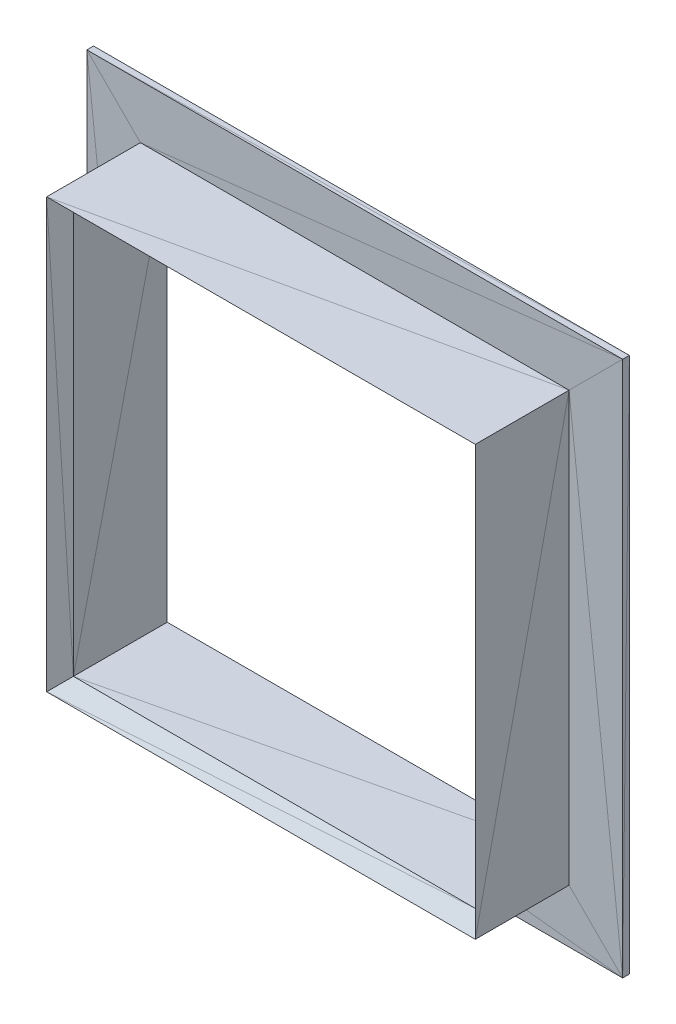
ISO-10303-21;
HEADER;
FILE_DESCRIPTION(('STEP AP214'),'2;1');
FILE_NAME('part.step','',(''),(''),'','','');
FILE_SCHEMA(('AUTOMOTIVE_DESIGN { 1 0 10303 214 1 1 1 1 }'));
ENDSEC;
DATA;
#1=APPLICATION_CONTEXT('core data for automotive mechanical design processes');
#2=APPLICATION_PROTOCOL_DEFINITION('international standard','automotive_design',2000,#1);
#3=PRODUCT_CONTEXT('',#1,'mechanical');
#4=PRODUCT('Part','Part','',(#3));
#5=PRODUCT_RELATED_PRODUCT_CATEGORY('part','',(#4));
#6=PRODUCT_DEFINITION_FORMATION('','',#4);
#7=PRODUCT_DEFINITION_CONTEXT('part definition',#1,'design');
#8=PRODUCT_DEFINITION('design','',#6,#7);
#9=PRODUCT_DEFINITION_SHAPE('','',#8);
#10=(LENGTH_UNIT() NAMED_UNIT(*) SI_UNIT(.MILLI.,.METRE.));
#11=(NAMED_UNIT(*) PLANE_ANGLE_UNIT() SI_UNIT($,.RADIAN.));
#12=(NAMED_UNIT(*) SI_UNIT($,.STERADIAN.) SOLID_ANGLE_UNIT());
#13=UNCERTAINTY_MEASURE_WITH_UNIT(LENGTH_MEASURE(1.E-05),#10,'distance_accuracy_value','');
#14=(GEOMETRIC_REPRESENTATION_CONTEXT(3) GLOBAL_UNCERTAINTY_ASSIGNED_CONTEXT((#13)) GLOBAL_UNIT_ASSIGNED_CONTEXT((#10,
#11,#12)) REPRESENTATION_CONTEXT('',''));
#15=CARTESIAN_POINT('',(0.,0.,0.));
#16=DIRECTION('',(0.,0.,1.));
#17=DIRECTION('',(1.,0.,0.));
#18=AXIS2_PLACEMENT_3D('',#15,#16,#17);
#19=CARTESIAN_POINT('',(0.,-14.9999996647239,0.));
#20=DIRECTION('',(0.,-1.,0.));
#21=DIRECTION('',(0.,0.,-1.));
#22=AXIS2_PLACEMENT_3D('',#19,#20,#21);
#23=PLANE('',#22);
#24=DIRECTION('',(0.,0.,1.));
#25=VECTOR('',#24,1.);
#26=CARTESIAN_POINT('',(14.9999996647239,-14.9999996647239,0.));
#27=LINE('',#26,#25);
#28=CARTESIAN_POINT('',(14.9999996647239,-14.9999996647239,0.));
#29=VERTEX_POINT('',#28);
#30=CARTESIAN_POINT('',(14.9999996647239,-14.9999996647239,7.00000021606684));
#31=VERTEX_POINT('',#30);
#32=EDGE_CURVE('E19',#29,#31,#27,.T.);
#33=ORIENTED_EDGE('',*,*,#32,.F.);
#34=DIRECTION('',(0.97384120706583,0.,-0.227229627074831));
#35=VECTOR('',#34,1.);
#36=CARTESIAN_POINT('',(-14.9999996647239,-14.9999996647239,7.00000021606684));
#37=LINE('',#36,#35);
#38=CARTESIAN_POINT('',(-14.9999996647239,-14.9999996647239,7.00000021606684));
#39=VERTEX_POINT('',#38);
#40=EDGE_CURVE('E133',#39,#29,#37,.T.);
#41=ORIENTED_EDGE('',*,*,#40,.F.);
#42=DIRECTION('',(-1.,0.,0.));
#43=VECTOR('',#42,1.);
#44=CARTESIAN_POINT('',(14.9999996647239,-14.9999996647239,7.00000021606684));
#45=LINE('',#44,#43);
#46=EDGE_CURVE('E151',#31,#39,#45,.T.);
#47=ORIENTED_EDGE('',*,*,#46,.F.);
#48=EDGE_LOOP('',(#33,#41,#47));
#49=FACE_BOUND('',#48,.T.);
#50=ADVANCED_FACE('F16',(#49),#23,.F.);
#51=CARTESIAN_POINT('',(0.,0.,0.));
#52=DIRECTION('',(0.,0.,-1.));
#53=DIRECTION('',(-1.,0.,0.));
#54=AXIS2_PLACEMENT_3D('',#51,#52,#53);
#55=PLANE('',#54);
#56=DIRECTION('',(0.991600408499459,0.129339204666278,0.));
#57=VECTOR('',#56,1.);
#58=CARTESIAN_POINT('',(-14.9999996647239,14.9999996647239,0.));
#59=LINE('',#58,#57);
#60=CARTESIAN_POINT('',(-14.9999996647239,14.9999996647239,0.));
#61=VERTEX_POINT('',#60);
#62=CARTESIAN_POINT('',(19.5000004023314,19.5000004023314,0.));
#63=VERTEX_POINT('',#62);
#64=EDGE_CURVE('E164',#61,#63,#59,.T.);
#65=ORIENTED_EDGE('',*,*,#64,.F.);
#66=DIRECTION('',(0.707106781186548,-0.707106781186548,0.));
#67=VECTOR('',#66,1.);
#68=CARTESIAN_POINT('',(-19.5000004023314,19.5000004023314,0.));
#69=LINE('',#68,#67);
#70=CARTESIAN_POINT('',(-19.5000004023314,19.5000004023314,0.));
#71=VERTEX_POINT('',#70);
#72=EDGE_CURVE('E289',#71,#61,#69,.T.);
#73=ORIENTED_EDGE('',*,*,#72,.F.);
#74=DIRECTION('',(-1.,0.,0.));
#75=VECTOR('',#74,1.);
#76=CARTESIAN_POINT('',(19.5000004023314,19.5000004023314,0.));
#77=LINE('',#76,#75);
#78=EDGE_CURVE('E193',#63,#71,#77,.T.);
#79=ORIENTED_EDGE('',*,*,#78,.F.);
#80=EDGE_LOOP('',(#65,#73,#79));
#81=FACE_BOUND('',#80,.T.);
#82=ADVANCED_FACE('F417',(#81),#55,.T.);
#83=CARTESIAN_POINT('',(14.9999996647239,0.,0.));
#84=DIRECTION('',(1.,0.,0.));
#85=DIRECTION('',(0.,0.,-1.));
#86=AXIS2_PLACEMENT_3D('',#83,#84,#85);
#87=PLANE('',#86);
#88=DIRECTION('',(0.,-1.,0.));
#89=VECTOR('',#88,1.);
#90=CARTESIAN_POINT('',(14.9999996647239,14.9999996647239,7.00000021606684));
#91=LINE('',#90,#89);
#92=CARTESIAN_POINT('',(14.9999996647239,14.9999996647239,7.00000021606684));
#93=VERTEX_POINT('',#92);
#94=EDGE_CURVE('E163',#93,#31,#91,.T.);
#95=ORIENTED_EDGE('',*,*,#94,.F.);
#96=DIRECTION('',(0.,0.97384120706583,0.227229627074831));
#97=VECTOR('',#96,1.);
#98=CARTESIAN_POINT('',(14.9999996647239,-14.9999996647239,0.));
#99=LINE('',#98,#97);
#100=EDGE_CURVE('E155',#29,#93,#99,.T.);
#101=ORIENTED_EDGE('',*,*,#100,.F.);
#102=ORIENTED_EDGE('',*,*,#32,.T.);
#103=EDGE_LOOP('',(#95,#101,#102));
#104=FACE_BOUND('',#103,.T.);
#105=ADVANCED_FACE('F161',(#104),#87,.F.);
#106=CARTESIAN_POINT('',(0.,0.,0.));
#107=DIRECTION('',(0.,0.,1.));
#108=DIRECTION('',(1.,0.,0.));
#109=AXIS2_PLACEMENT_3D('',#106,#107,#108);
#110=PLANE('',#109);
#111=DIRECTION('',(1.,0.,0.));
#112=VECTOR('',#111,1.);
#113=CARTESIAN_POINT('',(-14.9999996647239,14.9999996647239,0.));
#114=LINE('',#113,#112);
#115=CARTESIAN_POINT('',(14.9999996647239,14.9999996647239,0.));
#116=VERTEX_POINT('',#115);
#117=EDGE_CURVE('E171',#61,#116,#114,.T.);
#118=ORIENTED_EDGE('',*,*,#117,.F.);
#119=ORIENTED_EDGE('',*,*,#64,.T.);
#120=DIRECTION('',(0.707106781186548,0.707106781186548,0.));
#121=VECTOR('',#120,1.);
#122=CARTESIAN_POINT('',(14.9999996647239,14.9999996647239,0.));
#123=LINE('',#122,#121);
#124=EDGE_CURVE('E149',#116,#63,#123,.T.);
#125=ORIENTED_EDGE('',*,*,#124,.F.);
#126=EDGE_LOOP('',(#118,#119,#125));
#127=FACE_BOUND('',#126,.T.);
#128=ADVANCED_FACE('F181',(#127),#110,.F.);
#129=CARTESIAN_POINT('',(14.9999996647239,0.,0.));
#130=DIRECTION('',(1.,0.,0.));
#131=DIRECTION('',(0.,0.,-1.));
#132=AXIS2_PLACEMENT_3D('',#129,#130,#131);
#133=PLANE('',#132);
#134=DIRECTION('',(0.,1.,0.));
#135=VECTOR('',#134,1.);
#136=CARTESIAN_POINT('',(14.9999996647239,-14.9999996647239,0.));
#137=LINE('',#136,#135);
#138=EDGE_CURVE('E144',#29,#116,#137,.T.);
#139=ORIENTED_EDGE('',*,*,#138,.F.);
#140=ORIENTED_EDGE('',*,*,#100,.T.);
#141=DIRECTION('',(0.,0.,1.));
#142=VECTOR('',#141,1.);
#143=CARTESIAN_POINT('',(14.9999996647239,14.9999996647239,0.));
#144=LINE('',#143,#142);
#145=EDGE_CURVE('E115',#116,#93,#144,.T.);
#146=ORIENTED_EDGE('',*,*,#145,.F.);
#147=EDGE_LOOP('',(#139,#140,#146));
#148=FACE_BOUND('',#147,.T.);
#149=ADVANCED_FACE('F154',(#148),#133,.F.);
#150=CARTESIAN_POINT('',(0.,0.,0.));
#151=DIRECTION('',(0.,0.,1.));
#152=DIRECTION('',(1.,0.,0.));
#153=AXIS2_PLACEMENT_3D('',#150,#151,#152);
#154=PLANE('',#153);
#155=DIRECTION('',(-0.707106781186548,0.707106781186548,0.));
#156=VECTOR('',#155,1.);
#157=CARTESIAN_POINT('',(19.5000004023314,-19.5000004023314,0.));
#158=LINE('',#157,#156);
#159=CARTESIAN_POINT('',(19.5000004023314,-19.5000004023314,0.));
#160=VERTEX_POINT('',#159);
#161=EDGE_CURVE('E124',#160,#29,#158,.T.);
#162=ORIENTED_EDGE('',*,*,#161,.F.);
#163=DIRECTION('',(0.991600408499459,-0.129339204666278,0.));
#164=VECTOR('',#163,1.);
#165=CARTESIAN_POINT('',(-14.9999996647239,-14.9999996647239,0.));
#166=LINE('',#165,#164);
#167=CARTESIAN_POINT('',(-14.9999996647239,-14.9999996647239,0.));
#168=VERTEX_POINT('',#167);
#169=EDGE_CURVE('E127',#168,#160,#166,.T.);
#170=ORIENTED_EDGE('',*,*,#169,.F.);
#171=DIRECTION('',(-1.,0.,0.));
#172=VECTOR('',#171,1.);
#173=CARTESIAN_POINT('',(14.9999996647239,-14.9999996647239,0.));
#174=LINE('',#173,#172);
#175=EDGE_CURVE('E121',#29,#168,#174,.T.);
#176=ORIENTED_EDGE('',*,*,#175,.F.);
#177=EDGE_LOOP('',(#162,#170,#176));
#178=FACE_BOUND('',#177,.T.);
#179=ADVANCED_FACE('F123',(#178),#154,.F.);
#180=CARTESIAN_POINT('',(0.,0.,0.));
#181=DIRECTION('',(0.,0.,-1.));
#182=DIRECTION('',(-1.,0.,0.));
#183=AXIS2_PLACEMENT_3D('',#180,#181,#182);
#184=PLANE('',#183);
#185=ORIENTED_EDGE('',*,*,#138,.T.);
#186=ORIENTED_EDGE('',*,*,#124,.T.);
#187=DIRECTION('',(0.129339204666278,0.991600408499459,0.));
#188=VECTOR('',#187,1.);
#189=CARTESIAN_POINT('',(14.9999996647239,-14.9999996647239,0.));
#190=LINE('',#189,#188);
#191=EDGE_CURVE('E140',#29,#63,#190,.T.);
#192=ORIENTED_EDGE('',*,*,#191,.F.);
#193=EDGE_LOOP('',(#185,#186,#192));
#194=FACE_BOUND('',#193,.T.);
#195=ADVANCED_FACE('F147',(#194),#184,.T.);
#196=CARTESIAN_POINT('',(0.,0.,0.));
#197=DIRECTION('',(0.,0.,-1.));
#198=DIRECTION('',(-1.,0.,0.));
#199=AXIS2_PLACEMENT_3D('',#196,#197,#198);
#200=PLANE('',#199);
#201=DIRECTION('',(0.,1.,0.));
#202=VECTOR('',#201,1.);
#203=CARTESIAN_POINT('',(19.5000004023314,-19.5000004023314,0.));
#204=LINE('',#203,#202);
#205=EDGE_CURVE('E143',#160,#63,#204,.T.);
#206=ORIENTED_EDGE('',*,*,#205,.F.);
#207=ORIENTED_EDGE('',*,*,#161,.T.);
#208=ORIENTED_EDGE('',*,*,#191,.T.);
#209=EDGE_LOOP('',(#206,#207,#208));
#210=FACE_BOUND('',#209,.T.);
#211=ADVANCED_FACE('F139',(#210),#200,.T.);
#212=CARTESIAN_POINT('',(0.,-3.99999273941528,-3.9999964646982));
#213=DIRECTION('',(0.,-0.707106451914424,-0.707107110458517));
#214=DIRECTION('',(0.,0.707107110458518,-0.707106451914424));
#215=AXIS2_PLACEMENT_3D('',#212,#213,#214);
#216=PLANE('',#215);
#217=DIRECTION('',(0.577350448422543,0.577350448422543,-0.577349910723625));
#218=VECTOR('',#217,1.);
#219=CARTESIAN_POINT('',(-16.0000007599592,-16.0000007599592,8.00000037997961));
#220=LINE('',#219,#218);
#221=CARTESIAN_POINT('',(-16.0000007599592,-16.0000007599592,8.00000037997961));
#222=VERTEX_POINT('',#221);
#223=EDGE_CURVE('E134',#222,#39,#220,.T.);
#224=ORIENTED_EDGE('',*,*,#223,.F.);
#225=DIRECTION('',(-0.998961037402773,-0.0322245844456444,0.0322245544341943));
#226=VECTOR('',#225,1.);
#227=CARTESIAN_POINT('',(14.9999996647239,-14.9999996647239,7.00000021606684));
#228=LINE('',#227,#226);
#229=EDGE_CURVE('E394',#31,#222,#228,.T.);
#230=ORIENTED_EDGE('',*,*,#229,.F.);
#231=ORIENTED_EDGE('',*,*,#46,.T.);
#232=EDGE_LOOP('',(#224,#230,#231));
#233=FACE_BOUND('',#232,.T.);
#234=ADVANCED_FACE('F582',(#233),#216,.F.);
#235=CARTESIAN_POINT('',(-3.99999273941528,0.,-3.99999646469821));
#236=DIRECTION('',(0.707106451914424,0.,0.707107110458518));
#237=DIRECTION('',(0.707107110458517,0.,-0.707106451914424));
#238=AXIS2_PLACEMENT_3D('',#235,#236,#237);
#239=PLANE('',#238);
#240=ORIENTED_EDGE('',*,*,#223,.T.);
#241=DIRECTION('',(0.0322245844456444,-0.998961037402773,-0.0322245544341943));
#242=VECTOR('',#241,1.);
#243=CARTESIAN_POINT('',(-16.0000007599592,16.0000007599592,8.00000037997961));
#244=LINE('',#243,#242);
#245=CARTESIAN_POINT('',(-16.0000007599592,16.0000007599592,8.00000037997961));
#246=VERTEX_POINT('',#245);
#247=EDGE_CURVE('E253',#246,#39,#244,.T.);
#248=ORIENTED_EDGE('',*,*,#247,.F.);
#249=DIRECTION('',(0.,1.,0.));
#250=VECTOR('',#249,1.);
#251=CARTESIAN_POINT('',(-16.0000007599592,-16.0000007599592,8.00000037997961));
#252=LINE('',#251,#250);
#253=EDGE_CURVE('E379',#222,#246,#252,.T.);
#254=ORIENTED_EDGE('',*,*,#253,.F.);
#255=EDGE_LOOP('',(#240,#248,#254));
#256=FACE_BOUND('',#255,.T.);
#257=ADVANCED_FACE('F579',(#256),#239,.T.);
#258=CARTESIAN_POINT('',(0.,-14.9999996647239,0.));
#259=DIRECTION('',(0.,-1.,0.));
#260=DIRECTION('',(0.,0.,-1.));
#261=AXIS2_PLACEMENT_3D('',#258,#259,#260);
#262=PLANE('',#261);
#263=DIRECTION('',(0.,0.,-1.));
#264=VECTOR('',#263,1.);
#265=CARTESIAN_POINT('',(-14.9999996647239,-14.9999996647239,7.00000021606684));
#266=LINE('',#265,#264);
#267=EDGE_CURVE('E169',#39,#168,#266,.T.);
#268=ORIENTED_EDGE('',*,*,#267,.F.);
#269=ORIENTED_EDGE('',*,*,#40,.T.);
#270=ORIENTED_EDGE('',*,*,#175,.T.);
#271=EDGE_LOOP('',(#268,#269,#270));
#272=FACE_BOUND('',#271,.T.);
#273=ADVANCED_FACE('F168',(#272),#262,.F.);
#274=CARTESIAN_POINT('',(0.,14.9999996647239,0.));
#275=DIRECTION('',(0.,1.,0.));
#276=DIRECTION('',(0.,0.,1.));
#277=AXIS2_PLACEMENT_3D('',#274,#275,#276);
#278=PLANE('',#277);
#279=ORIENTED_EDGE('',*,*,#145,.T.);
#280=DIRECTION('',(0.97384120706583,0.,0.227229627074831));
#281=VECTOR('',#280,1.);
#282=CARTESIAN_POINT('',(-14.9999996647239,14.9999996647239,0.));
#283=LINE('',#282,#281);
#284=EDGE_CURVE('E250',#61,#93,#283,.T.);
#285=ORIENTED_EDGE('',*,*,#284,.F.);
#286=ORIENTED_EDGE('',*,*,#117,.T.);
#287=EDGE_LOOP('',(#279,#285,#286));
#288=FACE_BOUND('',#287,.T.);
#289=ADVANCED_FACE('F258',(#288),#278,.F.);
#290=CARTESIAN_POINT('',(-3.99999273941528,0.,-3.9999964646982));
#291=DIRECTION('',(-0.707106451914424,0.,-0.707107110458517));
#292=DIRECTION('',(-0.707107110458518,0.,0.707106451914424));
#293=AXIS2_PLACEMENT_3D('',#290,#291,#292);
#294=PLANE('',#293);
#295=DIRECTION('',(0.577350448422543,-0.577350448422543,-0.577349910723625));
#296=VECTOR('',#295,1.);
#297=CARTESIAN_POINT('',(-16.0000007599592,16.0000007599592,8.00000037997961));
#298=LINE('',#297,#296);
#299=CARTESIAN_POINT('',(-14.9999996647239,14.9999996647239,7.00000021606684));
#300=VERTEX_POINT('',#299);
#301=EDGE_CURVE('E228',#246,#300,#298,.T.);
#302=ORIENTED_EDGE('',*,*,#301,.F.);
#303=ORIENTED_EDGE('',*,*,#247,.T.);
#304=DIRECTION('',(0.,-1.,0.));
#305=VECTOR('',#304,1.);
#306=CARTESIAN_POINT('',(-14.9999996647239,14.9999996647239,7.00000021606684));
#307=LINE('',#306,#305);
#308=EDGE_CURVE('E245',#300,#39,#307,.T.);
#309=ORIENTED_EDGE('',*,*,#308,.F.);
#310=EDGE_LOOP('',(#302,#303,#309));
#311=FACE_BOUND('',#310,.T.);
#312=ADVANCED_FACE('F277',(#311),#294,.F.);
#313=CARTESIAN_POINT('',(-14.9999996647239,0.,0.));
#314=DIRECTION('',(-1.,0.,0.));
#315=DIRECTION('',(0.,0.,1.));
#316=AXIS2_PLACEMENT_3D('',#313,#314,#315);
#317=PLANE('',#316);
#318=DIRECTION('',(0.,-1.,0.));
#319=VECTOR('',#318,1.);
#320=CARTESIAN_POINT('',(-14.9999996647239,14.9999996647239,0.));
#321=LINE('',#320,#319);
#322=EDGE_CURVE('E284',#61,#168,#321,.T.);
#323=ORIENTED_EDGE('',*,*,#322,.F.);
#324=DIRECTION('',(0.,0.97384120706583,-0.227229627074831));
#325=VECTOR('',#324,1.);
#326=CARTESIAN_POINT('',(-14.9999996647239,-14.9999996647239,7.00000021606684));
#327=LINE('',#326,#325);
#328=EDGE_CURVE('E242',#39,#61,#327,.T.);
#329=ORIENTED_EDGE('',*,*,#328,.F.);
#330=ORIENTED_EDGE('',*,*,#267,.T.);
#331=EDGE_LOOP('',(#323,#329,#330));
#332=FACE_BOUND('',#331,.T.);
#333=ADVANCED_FACE('F282',(#332),#317,.F.);
#334=CARTESIAN_POINT('',(0.,14.9999996647239,0.));
#335=DIRECTION('',(0.,1.,0.));
#336=DIRECTION('',(0.,0.,1.));
#337=AXIS2_PLACEMENT_3D('',#334,#335,#336);
#338=PLANE('',#337);
#339=DIRECTION('',(0.,0.,1.));
#340=VECTOR('',#339,1.);
#341=CARTESIAN_POINT('',(-14.9999996647239,14.9999996647239,0.));
#342=LINE('',#341,#340);
#343=EDGE_CURVE('E241',#61,#300,#342,.T.);
#344=ORIENTED_EDGE('',*,*,#343,.F.);
#345=ORIENTED_EDGE('',*,*,#284,.T.);
#346=DIRECTION('',(1.,0.,0.));
#347=VECTOR('',#346,1.);
#348=CARTESIAN_POINT('',(-14.9999996647239,14.9999996647239,7.00000021606684));
#349=LINE('',#348,#347);
#350=EDGE_CURVE('E237',#300,#93,#349,.T.);
#351=ORIENTED_EDGE('',*,*,#350,.F.);
#352=EDGE_LOOP('',(#344,#345,#351));
#353=FACE_BOUND('',#352,.T.);
#354=ADVANCED_FACE('F271',(#353),#338,.F.);
#355=CARTESIAN_POINT('',(-14.9999996647239,0.,0.));
#356=DIRECTION('',(-1.,0.,0.));
#357=DIRECTION('',(0.,0.,1.));
#358=AXIS2_PLACEMENT_3D('',#355,#356,#357);
#359=PLANE('',#358);
#360=ORIENTED_EDGE('',*,*,#308,.T.);
#361=ORIENTED_EDGE('',*,*,#328,.T.);
#362=ORIENTED_EDGE('',*,*,#343,.T.);
#363=EDGE_LOOP('',(#360,#361,#362));
#364=FACE_BOUND('',#363,.T.);
#365=ADVANCED_FACE('F274',(#364),#359,.F.);
#366=CARTESIAN_POINT('',(3.99999273941528,0.,-3.9999964646982));
#367=DIRECTION('',(0.707106451914424,0.,-0.707107110458517));
#368=DIRECTION('',(-0.707107110458518,0.,-0.707106451914424));
#369=AXIS2_PLACEMENT_3D('',#366,#367,#368);
#370=PLANE('',#369);
#371=ORIENTED_EDGE('',*,*,#94,.T.);
#372=DIRECTION('',(-0.0322245844456444,-0.998961037402773,-0.0322245544341943));
#373=VECTOR('',#372,1.);
#374=CARTESIAN_POINT('',(16.0000007599592,16.0000007599592,8.00000037997961));
#375=LINE('',#374,#373);
#376=CARTESIAN_POINT('',(16.0000007599592,16.0000007599592,8.00000037997961));
#377=VERTEX_POINT('',#376);
#378=EDGE_CURVE('E264',#377,#31,#375,.T.);
#379=ORIENTED_EDGE('',*,*,#378,.F.);
#380=DIRECTION('',(0.577350448422543,0.577350448422543,0.577349910723625));
#381=VECTOR('',#380,1.);
#382=CARTESIAN_POINT('',(14.9999996647239,14.9999996647239,7.00000021606684));
#383=LINE('',#382,#381);
#384=EDGE_CURVE('E234',#93,#377,#383,.T.);
#385=ORIENTED_EDGE('',*,*,#384,.F.);
#386=EDGE_LOOP('',(#371,#379,#385));
#387=FACE_BOUND('',#386,.T.);
#388=ADVANCED_FACE('F261',(#387),#370,.F.);
#389=CARTESIAN_POINT('',(0.,3.99999273941528,-3.9999964646982));
#390=DIRECTION('',(0.,0.707106451914424,-0.707107110458517));
#391=DIRECTION('',(0.,0.707107110458518,0.707106451914424));
#392=AXIS2_PLACEMENT_3D('',#389,#390,#391);
#393=PLANE('',#392);
#394=ORIENTED_EDGE('',*,*,#384,.T.);
#395=DIRECTION('',(0.998961037402773,0.0322245844456444,0.0322245544341943));
#396=VECTOR('',#395,1.);
#397=CARTESIAN_POINT('',(-14.9999996647239,14.9999996647239,7.00000021606684));
#398=LINE('',#397,#396);
#399=EDGE_CURVE('E231',#300,#377,#398,.T.);
#400=ORIENTED_EDGE('',*,*,#399,.F.);
#401=ORIENTED_EDGE('',*,*,#350,.T.);
#402=EDGE_LOOP('',(#394,#400,#401));
#403=FACE_BOUND('',#402,.T.);
#404=ADVANCED_FACE('F268',(#403),#393,.F.);
#405=CARTESIAN_POINT('',(0.,-16.0000007599592,0.));
#406=DIRECTION('',(0.,1.,0.));
#407=DIRECTION('',(0.,0.,1.));
#408=AXIS2_PLACEMENT_3D('',#405,#406,#407);
#409=PLANE('',#408);
#410=DIRECTION('',(0.,0.,-1.));
#411=VECTOR('',#410,1.);
#412=CARTESIAN_POINT('',(16.0000007599592,-16.0000007599592,8.00000037997961));
#413=LINE('',#412,#411);
#414=CARTESIAN_POINT('',(16.0000007599592,-16.0000007599592,8.00000037997961));
#415=VERTEX_POINT('',#414);
#416=CARTESIAN_POINT('',(16.0000007599592,-16.0000007599592,1.00000004749745));
#417=VERTEX_POINT('',#416);
#418=EDGE_CURVE('E223',#415,#417,#413,.T.);
#419=ORIENTED_EDGE('',*,*,#418,.F.);
#420=DIRECTION('',(0.976900017396262,0.,0.213696878805432));
#421=VECTOR('',#420,1.);
#422=CARTESIAN_POINT('',(-16.0000007599592,-16.0000007599592,1.00000004749745));
#423=LINE('',#422,#421);
#424=CARTESIAN_POINT('',(-16.0000007599592,-16.0000007599592,1.00000004749745));
#425=VERTEX_POINT('',#424);
#426=EDGE_CURVE('E385',#425,#415,#423,.T.);
#427=ORIENTED_EDGE('',*,*,#426,.F.);
#428=DIRECTION('',(-1.,0.,0.));
#429=VECTOR('',#428,1.);
#430=CARTESIAN_POINT('',(16.0000007599592,-16.0000007599592,1.00000004749745));
#431=LINE('',#430,#429);
#432=EDGE_CURVE('E356',#417,#425,#431,.T.);
#433=ORIENTED_EDGE('',*,*,#432,.F.);
#434=EDGE_LOOP('',(#419,#427,#433));
#435=FACE_BOUND('',#434,.T.);
#436=ADVANCED_FACE('F558',(#435),#409,.F.);
#437=CARTESIAN_POINT('',(0.,3.99999273941528,-3.99999646469821));
#438=DIRECTION('',(0.,-0.707106451914424,0.707107110458518));
#439=DIRECTION('',(0.,-0.707107110458517,-0.707106451914424));
#440=AXIS2_PLACEMENT_3D('',#437,#438,#439);
#441=PLANE('',#440);
#442=ORIENTED_EDGE('',*,*,#301,.T.);
#443=ORIENTED_EDGE('',*,*,#399,.T.);
#444=DIRECTION('',(1.,0.,0.));
#445=VECTOR('',#444,1.);
#446=CARTESIAN_POINT('',(-16.0000007599592,16.0000007599592,8.00000037997961));
#447=LINE('',#446,#445);
#448=EDGE_CURVE('E220',#246,#377,#447,.T.);
#449=ORIENTED_EDGE('',*,*,#448,.F.);
#450=EDGE_LOOP('',(#442,#443,#449));
#451=FACE_BOUND('',#450,.T.);
#452=ADVANCED_FACE('F554',(#451),#441,.T.);
#453=CARTESIAN_POINT('',(0.,16.0000007599592,0.));
#454=DIRECTION('',(0.,-1.,0.));
#455=DIRECTION('',(0.,0.,-1.));
#456=AXIS2_PLACEMENT_3D('',#453,#454,#455);
#457=PLANE('',#456);
#458=DIRECTION('',(0.,0.,-1.));
#459=VECTOR('',#458,1.);
#460=CARTESIAN_POINT('',(-16.0000007599592,16.0000007599592,8.00000037997961));
#461=LINE('',#460,#459);
#462=CARTESIAN_POINT('',(-16.0000007599592,16.0000007599592,1.00000004749745));
#463=VERTEX_POINT('',#462);
#464=EDGE_CURVE('E371',#246,#463,#461,.T.);
#465=ORIENTED_EDGE('',*,*,#464,.F.);
#466=DIRECTION('',(-0.976900017396262,0.,0.213696878805432));
#467=VECTOR('',#466,1.);
#468=CARTESIAN_POINT('',(16.0000007599592,16.0000007599592,1.00000004749745));
#469=LINE('',#468,#467);
#470=CARTESIAN_POINT('',(16.0000007599592,16.0000007599592,1.00000004749745));
#471=VERTEX_POINT('',#470);
#472=EDGE_CURVE('E217',#471,#246,#469,.T.);
#473=ORIENTED_EDGE('',*,*,#472,.F.);
#474=DIRECTION('',(1.,0.,0.));
#475=VECTOR('',#474,1.);
#476=CARTESIAN_POINT('',(-16.0000007599592,16.0000007599592,1.00000004749745));
#477=LINE('',#476,#475);
#478=EDGE_CURVE('E348',#463,#471,#477,.T.);
#479=ORIENTED_EDGE('',*,*,#478,.F.);
#480=EDGE_LOOP('',(#465,#473,#479));
#481=FACE_BOUND('',#480,.T.);
#482=ADVANCED_FACE('F550',(#481),#457,.F.);
#483=CARTESIAN_POINT('',(16.0000007599592,0.,0.));
#484=DIRECTION('',(-1.,0.,0.));
#485=DIRECTION('',(0.,0.,1.));
#486=AXIS2_PLACEMENT_3D('',#483,#484,#485);
#487=PLANE('',#486);
#488=DIRECTION('',(0.,-1.,0.));
#489=VECTOR('',#488,1.);
#490=CARTESIAN_POINT('',(16.0000007599592,16.0000007599592,1.00000004749745));
#491=LINE('',#490,#489);
#492=EDGE_CURVE('E341',#471,#417,#491,.T.);
#493=ORIENTED_EDGE('',*,*,#492,.F.);
#494=DIRECTION('',(0.,0.976900017396262,-0.213696878805432));
#495=VECTOR('',#494,1.);
#496=CARTESIAN_POINT('',(16.0000007599592,-16.0000007599592,8.00000037997961));
#497=LINE('',#496,#495);
#498=EDGE_CURVE('E214',#415,#471,#497,.T.);
#499=ORIENTED_EDGE('',*,*,#498,.F.);
#500=ORIENTED_EDGE('',*,*,#418,.T.);
#501=EDGE_LOOP('',(#493,#499,#500));
#502=FACE_BOUND('',#501,.T.);
#503=ADVANCED_FACE('F546',(#502),#487,.F.);
#504=CARTESIAN_POINT('',(0.,16.0000007599592,0.));
#505=DIRECTION('',(0.,-1.,0.));
#506=DIRECTION('',(0.,0.,-1.));
#507=AXIS2_PLACEMENT_3D('',#504,#505,#506);
#508=PLANE('',#507);
#509=DIRECTION('',(0.,0.,1.));
#510=VECTOR('',#509,1.);
#511=CARTESIAN_POINT('',(16.0000007599592,16.0000007599592,1.00000004749745));
#512=LINE('',#511,#510);
#513=EDGE_CURVE('E194',#471,#377,#512,.T.);
#514=ORIENTED_EDGE('',*,*,#513,.F.);
#515=ORIENTED_EDGE('',*,*,#472,.T.);
#516=ORIENTED_EDGE('',*,*,#448,.T.);
#517=EDGE_LOOP('',(#514,#515,#516));
#518=FACE_BOUND('',#517,.T.);
#519=ADVANCED_FACE('F542',(#518),#508,.F.);
#520=CARTESIAN_POINT('',(16.0000007599592,0.,0.));
#521=DIRECTION('',(-1.,0.,0.));
#522=DIRECTION('',(0.,0.,1.));
#523=AXIS2_PLACEMENT_3D('',#520,#521,#522);
#524=PLANE('',#523);
#525=DIRECTION('',(0.,1.,0.));
#526=VECTOR('',#525,1.);
#527=CARTESIAN_POINT('',(16.0000007599592,-16.0000007599592,8.00000037997961));
#528=LINE('',#527,#526);
#529=EDGE_CURVE('E397',#415,#377,#528,.T.);
#530=ORIENTED_EDGE('',*,*,#529,.F.);
#531=ORIENTED_EDGE('',*,*,#498,.T.);
#532=ORIENTED_EDGE('',*,*,#513,.T.);
#533=EDGE_LOOP('',(#530,#531,#532));
#534=FACE_BOUND('',#533,.T.);
#535=ADVANCED_FACE('F539',(#534),#524,.F.);
#536=CARTESIAN_POINT('',(9.7500172269209,0.,-9.75000020115081));
#537=DIRECTION('',(-0.707107398572264,0.,0.707106163800292));
#538=DIRECTION('',(0.707106163800292,0.,0.707107398572264));
#539=AXIS2_PLACEMENT_3D('',#536,#537,#538);
#540=PLANE('',#539);
#541=DIRECTION('',(-0.577349933126968,-0.577349933126968,-0.577350941314355));
#542=VECTOR('',#541,1.);
#543=CARTESIAN_POINT('',(19.9999995529652,19.9999995529652,0.500000023748726));
#544=LINE('',#543,#542);
#545=CARTESIAN_POINT('',(19.9999995529652,19.9999995529652,0.500000023748726));
#546=VERTEX_POINT('',#545);
#547=EDGE_CURVE('E189',#546,#63,#544,.T.);
#548=ORIENTED_EDGE('',*,*,#547,.F.);
#549=DIRECTION('',(0.0126561786165023,0.999839808032384,0.0126562007171364));
#550=VECTOR('',#549,1.);
#551=CARTESIAN_POINT('',(19.5000004023314,-19.5000004023314,0.));
#552=LINE('',#551,#550);
#553=EDGE_CURVE('E192',#160,#546,#552,.T.);
#554=ORIENTED_EDGE('',*,*,#553,.F.);
#555=ORIENTED_EDGE('',*,*,#205,.T.);
#556=EDGE_LOOP('',(#548,#554,#555));
#557=FACE_BOUND('',#556,.T.);
#558=ADVANCED_FACE('F187',(#557),#540,.F.);
#559=CARTESIAN_POINT('',(0.,9.7500172269209,-9.75000020115081));
#560=DIRECTION('',(0.,-0.707107398572264,0.707106163800292));
#561=DIRECTION('',(0.,-0.707106163800292,-0.707107398572264));
#562=AXIS2_PLACEMENT_3D('',#559,#560,#561);
#563=PLANE('',#562);
#564=DIRECTION('',(0.577349933126968,-0.577349933126968,-0.577350941314355));
#565=VECTOR('',#564,1.);
#566=CARTESIAN_POINT('',(-19.9999995529652,19.9999995529652,0.500000023748726));
#567=LINE('',#566,#565);
#568=CARTESIAN_POINT('',(-19.9999995529652,19.9999995529652,0.500000023748726));
#569=VERTEX_POINT('',#568);
#570=EDGE_CURVE('E202',#569,#71,#567,.T.);
#571=ORIENTED_EDGE('',*,*,#570,.F.);
#572=DIRECTION('',(-0.999839808032384,0.0126561786165023,0.0126562007171364));
#573=VECTOR('',#572,1.);
#574=CARTESIAN_POINT('',(19.5000004023314,19.5000004023314,0.));
#575=LINE('',#574,#573);
#576=EDGE_CURVE('E199',#63,#569,#575,.T.);
#577=ORIENTED_EDGE('',*,*,#576,.F.);
#578=ORIENTED_EDGE('',*,*,#78,.T.);
#579=EDGE_LOOP('',(#571,#577,#578));
#580=FACE_BOUND('',#579,.T.);
#581=ADVANCED_FACE('F200',(#580),#563,.F.);
#582=CARTESIAN_POINT('',(0.,19.9999995529652,0.));
#583=DIRECTION('',(0.,-1.,0.));
#584=DIRECTION('',(0.,0.,-1.));
#585=AXIS2_PLACEMENT_3D('',#582,#583,#584);
#586=PLANE('',#585);
#587=DIRECTION('',(0.,0.,-1.));
#588=VECTOR('',#587,1.);
#589=CARTESIAN_POINT('',(-19.9999995529652,19.9999995529652,1.00000004749745));
#590=LINE('',#589,#588);
#591=CARTESIAN_POINT('',(-19.9999995529652,19.9999995529652,1.00000004749745));
#592=VERTEX_POINT('',#591);
#593=EDGE_CURVE('E319',#592,#569,#590,.T.);
#594=ORIENTED_EDGE('',*,*,#593,.F.);
#595=DIRECTION('',(-0.99992188414317,0.,0.0124990244248364));
#596=VECTOR('',#595,1.);
#597=CARTESIAN_POINT('',(19.9999995529652,19.9999995529652,0.500000023748726));
#598=LINE('',#597,#596);
#599=EDGE_CURVE('E374',#546,#592,#598,.T.);
#600=ORIENTED_EDGE('',*,*,#599,.F.);
#601=DIRECTION('',(1.,0.,0.));
#602=VECTOR('',#601,1.);
#603=CARTESIAN_POINT('',(-19.9999995529652,19.9999995529652,0.500000023748726));
#604=LINE('',#603,#602);
#605=EDGE_CURVE('E207',#569,#546,#604,.T.);
#606=ORIENTED_EDGE('',*,*,#605,.F.);
#607=EDGE_LOOP('',(#594,#600,#606));
#608=FACE_BOUND('',#607,.T.);
#609=ADVANCED_FACE('F531',(#608),#586,.F.);
#610=CARTESIAN_POINT('',(0.,9.7500172269209,-9.75000020115081));
#611=DIRECTION('',(0.,0.707107398572264,-0.707106163800292));
#612=DIRECTION('',(0.,0.707106163800292,0.707107398572264));
#613=AXIS2_PLACEMENT_3D('',#610,#611,#612);
#614=PLANE('',#613);
#615=ORIENTED_EDGE('',*,*,#547,.T.);
#616=ORIENTED_EDGE('',*,*,#576,.T.);
#617=ORIENTED_EDGE('',*,*,#605,.T.);
#618=EDGE_LOOP('',(#615,#616,#617));
#619=FACE_BOUND('',#618,.T.);
#620=ADVANCED_FACE('F209',(#619),#614,.T.);
#621=CARTESIAN_POINT('',(0.,-9.7500172269209,-9.75000020115081));
#622=DIRECTION('',(0.,0.707107398572264,0.707106163800292));
#623=DIRECTION('',(0.,-0.707106163800292,0.707107398572264));
#624=AXIS2_PLACEMENT_3D('',#621,#622,#623);
#625=PLANE('',#624);
#626=DIRECTION('',(-0.577349933126968,0.577349933126968,-0.577350941314355));
#627=VECTOR('',#626,1.);
#628=CARTESIAN_POINT('',(19.9999995529652,-19.9999995529652,0.500000023748726));
#629=LINE('',#628,#627);
#630=CARTESIAN_POINT('',(19.9999995529652,-19.9999995529652,0.500000023748726));
#631=VERTEX_POINT('',#630);
#632=EDGE_CURVE('E306',#631,#160,#629,.T.);
#633=ORIENTED_EDGE('',*,*,#632,.F.);
#634=DIRECTION('',(0.999839808032384,-0.0126561786165023,0.0126562007171364));
#635=VECTOR('',#634,1.);
#636=CARTESIAN_POINT('',(-19.5000004023314,-19.5000004023314,0.));
#637=LINE('',#636,#635);
#638=CARTESIAN_POINT('',(-19.5000004023314,-19.5000004023314,0.));
#639=VERTEX_POINT('',#638);
#640=EDGE_CURVE('E308',#639,#631,#637,.T.);
#641=ORIENTED_EDGE('',*,*,#640,.F.);
#642=DIRECTION('',(-1.,0.,0.));
#643=VECTOR('',#642,1.);
#644=CARTESIAN_POINT('',(19.5000004023314,-19.5000004023314,0.));
#645=LINE('',#644,#643);
#646=EDGE_CURVE('E293',#160,#639,#645,.T.);
#647=ORIENTED_EDGE('',*,*,#646,.F.);
#648=EDGE_LOOP('',(#633,#641,#647));
#649=FACE_BOUND('',#648,.T.);
#650=ADVANCED_FACE('F305',(#649),#625,.F.);
#651=CARTESIAN_POINT('',(0.,0.,0.));
#652=DIRECTION('',(0.,0.,-1.));
#653=DIRECTION('',(-1.,0.,0.));
#654=AXIS2_PLACEMENT_3D('',#651,#652,#653);
#655=PLANE('',#654);
#656=ORIENTED_EDGE('',*,*,#646,.T.);
#657=DIRECTION('',(-0.707106781186548,-0.707106781186548,0.));
#658=VECTOR('',#657,1.);
#659=CARTESIAN_POINT('',(-14.9999996647239,-14.9999996647239,0.));
#660=LINE('',#659,#658);
#661=EDGE_CURVE('E288',#168,#639,#660,.T.);
#662=ORIENTED_EDGE('',*,*,#661,.F.);
#663=ORIENTED_EDGE('',*,*,#169,.T.);
#664=EDGE_LOOP('',(#656,#662,#663));
#665=FACE_BOUND('',#664,.T.);
#666=ADVANCED_FACE('F301',(#665),#655,.T.);
#667=CARTESIAN_POINT('',(0.,0.,0.));
#668=DIRECTION('',(0.,0.,-1.));
#669=DIRECTION('',(-1.,0.,0.));
#670=AXIS2_PLACEMENT_3D('',#667,#668,#669);
#671=PLANE('',#670);
#672=DIRECTION('',(0.,-1.,0.));
#673=VECTOR('',#672,1.);
#674=CARTESIAN_POINT('',(-19.5000004023314,19.5000004023314,0.));
#675=LINE('',#674,#673);
#676=EDGE_CURVE('E403',#71,#639,#675,.T.);
#677=ORIENTED_EDGE('',*,*,#676,.F.);
#678=ORIENTED_EDGE('',*,*,#72,.T.);
#679=DIRECTION('',(0.129339204666278,0.991600408499459,0.));
#680=VECTOR('',#679,1.);
#681=CARTESIAN_POINT('',(-19.5000004023314,-19.5000004023314,0.));
#682=LINE('',#681,#680);
#683=EDGE_CURVE('E291',#639,#61,#682,.T.);
#684=ORIENTED_EDGE('',*,*,#683,.F.);
#685=EDGE_LOOP('',(#677,#678,#684));
#686=FACE_BOUND('',#685,.T.);
#687=ADVANCED_FACE('F416',(#686),#671,.T.);
#688=CARTESIAN_POINT('',(0.,0.,0.));
#689=DIRECTION('',(0.,0.,-1.));
#690=DIRECTION('',(-1.,0.,0.));
#691=AXIS2_PLACEMENT_3D('',#688,#689,#690);
#692=PLANE('',#691);
#693=ORIENTED_EDGE('',*,*,#322,.T.);
#694=ORIENTED_EDGE('',*,*,#661,.T.);
#695=ORIENTED_EDGE('',*,*,#683,.T.);
#696=EDGE_LOOP('',(#693,#694,#695));
#697=FACE_BOUND('',#696,.T.);
#698=ADVANCED_FACE('F413',(#697),#692,.T.);
#699=CARTESIAN_POINT('',(0.,-9.7500172269209,-9.75000020115081));
#700=DIRECTION('',(0.,-0.707107398572264,-0.707106163800292));
#701=DIRECTION('',(0.,0.707106163800292,-0.707107398572264));
#702=AXIS2_PLACEMENT_3D('',#699,#700,#701);
#703=PLANE('',#702);
#704=DIRECTION('',(-0.577349933126968,-0.577349933126968,0.577350941314355));
#705=VECTOR('',#704,1.);
#706=CARTESIAN_POINT('',(-19.5000004023314,-19.5000004023314,0.));
#707=LINE('',#706,#705);
#708=CARTESIAN_POINT('',(-19.9999995529652,-19.9999995529652,0.500000023748726));
#709=VERTEX_POINT('',#708);
#710=EDGE_CURVE('E407',#639,#709,#707,.T.);
#711=ORIENTED_EDGE('',*,*,#710,.F.);
#712=ORIENTED_EDGE('',*,*,#640,.T.);
#713=DIRECTION('',(1.,0.,0.));
#714=VECTOR('',#713,1.);
#715=CARTESIAN_POINT('',(-19.9999995529652,-19.9999995529652,0.500000023748726));
#716=LINE('',#715,#714);
#717=EDGE_CURVE('E950',#709,#631,#716,.T.);
#718=ORIENTED_EDGE('',*,*,#717,.F.);
#719=EDGE_LOOP('',(#711,#712,#718));
#720=FACE_BOUND('',#719,.T.);
#721=ADVANCED_FACE('F517',(#720),#703,.T.);
#722=CARTESIAN_POINT('',(-9.7500172269209,0.,-9.75000020115081));
#723=DIRECTION('',(0.707107398572264,0.,0.707106163800292));
#724=DIRECTION('',(0.707106163800292,0.,-0.707107398572264));
#725=AXIS2_PLACEMENT_3D('',#722,#723,#724);
#726=PLANE('',#725);
#727=DIRECTION('',(0.,-1.,0.));
#728=VECTOR('',#727,1.);
#729=CARTESIAN_POINT('',(-19.9999995529652,19.9999995529652,0.500000023748726));
#730=LINE('',#729,#728);
#731=EDGE_CURVE('E326',#569,#709,#730,.T.);
#732=ORIENTED_EDGE('',*,*,#731,.F.);
#733=DIRECTION('',(-0.0126561786165023,0.999839808032384,0.0126562007171364));
#734=VECTOR('',#733,1.);
#735=CARTESIAN_POINT('',(-19.5000004023314,-19.5000004023314,0.));
#736=LINE('',#735,#734);
#737=EDGE_CURVE('E400',#639,#569,#736,.T.);
#738=ORIENTED_EDGE('',*,*,#737,.F.);
#739=ORIENTED_EDGE('',*,*,#710,.T.);
#740=EDGE_LOOP('',(#732,#738,#739));
#741=FACE_BOUND('',#740,.T.);
#742=ADVANCED_FACE('F513',(#741),#726,.F.);
#743=CARTESIAN_POINT('',(-9.7500172269209,0.,-9.75000020115081));
#744=DIRECTION('',(0.707107398572264,0.,0.707106163800292));
#745=DIRECTION('',(0.707106163800292,0.,-0.707107398572264));
#746=AXIS2_PLACEMENT_3D('',#743,#744,#745);
#747=PLANE('',#746);
#748=ORIENTED_EDGE('',*,*,#676,.T.);
#749=ORIENTED_EDGE('',*,*,#737,.T.);
#750=ORIENTED_EDGE('',*,*,#570,.T.);
#751=EDGE_LOOP('',(#748,#749,#750));
#752=FACE_BOUND('',#751,.T.);
#753=ADVANCED_FACE('F509',(#752),#747,.F.);
#754=CARTESIAN_POINT('',(3.99999273941528,0.,-3.9999964646982));
#755=DIRECTION('',(0.707106451914424,0.,-0.707107110458517));
#756=DIRECTION('',(-0.707107110458518,0.,-0.707106451914424));
#757=AXIS2_PLACEMENT_3D('',#754,#755,#756);
#758=PLANE('',#757);
#759=ORIENTED_EDGE('',*,*,#529,.T.);
#760=ORIENTED_EDGE('',*,*,#378,.T.);
#761=DIRECTION('',(-0.577350448422543,0.577350448422543,-0.577349910723625));
#762=VECTOR('',#761,1.);
#763=CARTESIAN_POINT('',(16.0000007599592,-16.0000007599592,8.00000037997961));
#764=LINE('',#763,#762);
#765=EDGE_CURVE('E389',#415,#31,#764,.T.);
#766=ORIENTED_EDGE('',*,*,#765,.F.);
#767=EDGE_LOOP('',(#759,#760,#766));
#768=FACE_BOUND('',#767,.T.);
#769=ADVANCED_FACE('F505',(#768),#758,.F.);
#770=CARTESIAN_POINT('',(0.,-3.99999273941528,-3.99999646469821));
#771=DIRECTION('',(0.,0.707106451914424,0.707107110458518));
#772=DIRECTION('',(0.,-0.707107110458517,0.707106451914424));
#773=AXIS2_PLACEMENT_3D('',#770,#771,#772);
#774=PLANE('',#773);
#775=ORIENTED_EDGE('',*,*,#765,.T.);
#776=ORIENTED_EDGE('',*,*,#229,.T.);
#777=DIRECTION('',(-1.,0.,0.));
#778=VECTOR('',#777,1.);
#779=CARTESIAN_POINT('',(16.0000007599592,-16.0000007599592,8.00000037997961));
#780=LINE('',#779,#778);
#781=EDGE_CURVE('E386',#415,#222,#780,.T.);
#782=ORIENTED_EDGE('',*,*,#781,.F.);
#783=EDGE_LOOP('',(#775,#776,#782));
#784=FACE_BOUND('',#783,.T.);
#785=ADVANCED_FACE('F501',(#784),#774,.T.);
#786=CARTESIAN_POINT('',(0.,-16.0000007599592,0.));
#787=DIRECTION('',(0.,1.,0.));
#788=DIRECTION('',(0.,0.,1.));
#789=AXIS2_PLACEMENT_3D('',#786,#787,#788);
#790=PLANE('',#789);
#791=DIRECTION('',(0.,0.,1.));
#792=VECTOR('',#791,1.);
#793=CARTESIAN_POINT('',(-16.0000007599592,-16.0000007599592,1.00000004749745));
#794=LINE('',#793,#792);
#795=EDGE_CURVE('E382',#425,#222,#794,.T.);
#796=ORIENTED_EDGE('',*,*,#795,.F.);
#797=ORIENTED_EDGE('',*,*,#426,.T.);
#798=ORIENTED_EDGE('',*,*,#781,.T.);
#799=EDGE_LOOP('',(#796,#797,#798));
#800=FACE_BOUND('',#799,.T.);
#801=ADVANCED_FACE('F497',(#800),#790,.F.);
#802=CARTESIAN_POINT('',(-16.0000007599592,0.,0.));
#803=DIRECTION('',(1.,0.,0.));
#804=DIRECTION('',(0.,0.,-1.));
#805=AXIS2_PLACEMENT_3D('',#802,#803,#804);
#806=PLANE('',#805);
#807=ORIENTED_EDGE('',*,*,#253,.T.);
#808=DIRECTION('',(0.,0.976900017396262,0.213696878805432));
#809=VECTOR('',#808,1.);
#810=CARTESIAN_POINT('',(-16.0000007599592,-16.0000007599592,1.00000004749745));
#811=LINE('',#810,#809);
#812=EDGE_CURVE('E370',#425,#246,#811,.T.);
#813=ORIENTED_EDGE('',*,*,#812,.F.);
#814=ORIENTED_EDGE('',*,*,#795,.T.);
#815=EDGE_LOOP('',(#807,#813,#814));
#816=FACE_BOUND('',#815,.T.);
#817=ADVANCED_FACE('F493',(#816),#806,.F.);
#818=CARTESIAN_POINT('',(0.,19.9999995529652,0.));
#819=DIRECTION('',(0.,-1.,0.));
#820=DIRECTION('',(0.,0.,-1.));
#821=AXIS2_PLACEMENT_3D('',#818,#819,#820);
#822=PLANE('',#821);
#823=DIRECTION('',(0.,0.,1.));
#824=VECTOR('',#823,1.);
#825=CARTESIAN_POINT('',(19.9999995529652,19.9999995529652,0.500000023748726));
#826=LINE('',#825,#824);
#827=CARTESIAN_POINT('',(19.9999995529652,19.9999995529652,1.00000004749745));
#828=VERTEX_POINT('',#827);
#829=EDGE_CURVE('E351',#546,#828,#826,.T.);
#830=ORIENTED_EDGE('',*,*,#829,.F.);
#831=ORIENTED_EDGE('',*,*,#599,.T.);
#832=DIRECTION('',(-1.,0.,0.));
#833=VECTOR('',#832,1.);
#834=CARTESIAN_POINT('',(19.9999995529652,19.9999995529652,1.00000004749745));
#835=LINE('',#834,#833);
#836=EDGE_CURVE('E367',#828,#592,#835,.T.);
#837=ORIENTED_EDGE('',*,*,#836,.F.);
#838=EDGE_LOOP('',(#830,#831,#837));
#839=FACE_BOUND('',#838,.T.);
#840=ADVANCED_FACE('F489',(#839),#822,.F.);
#841=CARTESIAN_POINT('',(-16.0000007599592,0.,0.));
#842=DIRECTION('',(1.,0.,0.));
#843=DIRECTION('',(0.,0.,-1.));
#844=AXIS2_PLACEMENT_3D('',#841,#842,#843);
#845=PLANE('',#844);
#846=DIRECTION('',(0.,1.,0.));
#847=VECTOR('',#846,1.);
#848=CARTESIAN_POINT('',(-16.0000007599592,-16.0000007599592,1.00000004749745));
#849=LINE('',#848,#847);
#850=EDGE_CURVE('E362',#425,#463,#849,.T.);
#851=ORIENTED_EDGE('',*,*,#850,.F.);
#852=ORIENTED_EDGE('',*,*,#812,.T.);
#853=ORIENTED_EDGE('',*,*,#464,.T.);
#854=EDGE_LOOP('',(#851,#852,#853));
#855=FACE_BOUND('',#854,.T.);
#856=ADVANCED_FACE('F485',(#855),#845,.F.);
#857=CARTESIAN_POINT('',(0.,0.,1.00000004749745));
#858=DIRECTION('',(0.,0.,1.));
#859=DIRECTION('',(1.,0.,0.));
#860=AXIS2_PLACEMENT_3D('',#857,#858,#859);
#861=PLANE('',#860);
#862=ORIENTED_EDGE('',*,*,#836,.T.);
#863=DIRECTION('',(-0.707106781186548,0.707106781186548,0.));
#864=VECTOR('',#863,1.);
#865=CARTESIAN_POINT('',(-16.0000007599592,16.0000007599592,1.00000004749745));
#866=LINE('',#865,#864);
#867=EDGE_CURVE('E360',#463,#592,#866,.T.);
#868=ORIENTED_EDGE('',*,*,#867,.F.);
#869=DIRECTION('',(-0.993883738436327,-0.110431492210468,0.));
#870=VECTOR('',#869,1.);
#871=CARTESIAN_POINT('',(19.9999995529652,19.9999995529652,1.00000004749745));
#872=LINE('',#871,#870);
#873=EDGE_CURVE('E347',#828,#463,#872,.T.);
#874=ORIENTED_EDGE('',*,*,#873,.F.);
#875=EDGE_LOOP('',(#862,#868,#874));
#876=FACE_BOUND('',#875,.T.);
#877=ADVANCED_FACE('F482',(#876),#861,.T.);
#878=CARTESIAN_POINT('',(0.,0.,1.00000004749745));
#879=DIRECTION('',(0.,0.,1.));
#880=DIRECTION('',(1.,0.,0.));
#881=AXIS2_PLACEMENT_3D('',#878,#879,#880);
#882=PLANE('',#881);
#883=DIRECTION('',(0.,1.,0.));
#884=VECTOR('',#883,1.);
#885=CARTESIAN_POINT('',(-19.9999995529652,-19.9999995529652,1.00000004749745));
#886=LINE('',#885,#884);
#887=CARTESIAN_POINT('',(-19.9999995529652,-19.9999995529652,1.00000004749745));
#888=VERTEX_POINT('',#887);
#889=EDGE_CURVE('E34',#888,#592,#886,.T.);
#890=ORIENTED_EDGE('',*,*,#889,.F.);
#891=DIRECTION('',(-0.707106781186548,-0.707106781186548,0.));
#892=VECTOR('',#891,1.);
#893=CARTESIAN_POINT('',(-16.0000007599592,-16.0000007599592,1.00000004749745));
#894=LINE('',#893,#892);
#895=EDGE_CURVE('E954',#425,#888,#894,.T.);
#896=ORIENTED_EDGE('',*,*,#895,.F.);
#897=DIRECTION('',(0.110431492210468,-0.993883738436327,0.));
#898=VECTOR('',#897,1.);
#899=CARTESIAN_POINT('',(-19.9999995529652,19.9999995529652,1.00000004749745));
#900=LINE('',#899,#898);
#901=EDGE_CURVE('E359',#592,#425,#900,.T.);
#902=ORIENTED_EDGE('',*,*,#901,.F.);
#903=EDGE_LOOP('',(#890,#896,#902));
#904=FACE_BOUND('',#903,.T.);
#905=ADVANCED_FACE('F478',(#904),#882,.T.);
#906=CARTESIAN_POINT('',(0.,0.,1.00000004749745));
#907=DIRECTION('',(0.,0.,1.));
#908=DIRECTION('',(1.,0.,0.));
#909=AXIS2_PLACEMENT_3D('',#906,#907,#908);
#910=PLANE('',#909);
#911=ORIENTED_EDGE('',*,*,#850,.T.);
#912=ORIENTED_EDGE('',*,*,#867,.T.);
#913=ORIENTED_EDGE('',*,*,#901,.T.);
#914=EDGE_LOOP('',(#911,#912,#913));
#915=FACE_BOUND('',#914,.T.);
#916=ADVANCED_FACE('F474',(#915),#910,.T.);
#917=CARTESIAN_POINT('',(0.,0.,1.00000004749745));
#918=DIRECTION('',(0.,0.,-1.));
#919=DIRECTION('',(-1.,0.,0.));
#920=AXIS2_PLACEMENT_3D('',#917,#918,#919);
#921=PLANE('',#920);
#922=ORIENTED_EDGE('',*,*,#432,.T.);
#923=DIRECTION('',(-0.993883738436327,0.110431492210468,0.));
#924=VECTOR('',#923,1.);
#925=CARTESIAN_POINT('',(19.9999995529652,-19.9999995529652,1.00000004749745));
#926=LINE('',#925,#924);
#927=CARTESIAN_POINT('',(19.9999995529652,-19.9999995529652,1.00000004749745));
#928=VERTEX_POINT('',#927);
#929=EDGE_CURVE('E958',#928,#425,#926,.T.);
#930=ORIENTED_EDGE('',*,*,#929,.F.);
#931=DIRECTION('',(0.707106781186548,-0.707106781186548,0.));
#932=VECTOR('',#931,1.);
#933=CARTESIAN_POINT('',(16.0000007599592,-16.0000007599592,1.00000004749745));
#934=LINE('',#933,#932);
#935=EDGE_CURVE('E344',#417,#928,#934,.T.);
#936=ORIENTED_EDGE('',*,*,#935,.F.);
#937=EDGE_LOOP('',(#922,#930,#936));
#938=FACE_BOUND('',#937,.T.);
#939=ADVANCED_FACE('F470',(#938),#921,.F.);
#940=CARTESIAN_POINT('',(19.9999995529652,0.,0.));
#941=DIRECTION('',(-1.,0.,0.));
#942=DIRECTION('',(0.,0.,1.));
#943=AXIS2_PLACEMENT_3D('',#940,#941,#942);
#944=PLANE('',#943);
#945=DIRECTION('',(0.,1.,0.));
#946=VECTOR('',#945,1.);
#947=CARTESIAN_POINT('',(19.9999995529652,-19.9999995529652,1.00000004749745));
#948=LINE('',#947,#946);
#949=EDGE_CURVE('E336',#928,#828,#948,.T.);
#950=ORIENTED_EDGE('',*,*,#949,.F.);
#951=DIRECTION('',(0.,-0.99992188414317,0.0124990244248364));
#952=VECTOR('',#951,1.);
#953=CARTESIAN_POINT('',(19.9999995529652,19.9999995529652,0.500000023748726));
#954=LINE('',#953,#952);
#955=EDGE_CURVE('E315',#546,#928,#954,.T.);
#956=ORIENTED_EDGE('',*,*,#955,.F.);
#957=ORIENTED_EDGE('',*,*,#829,.T.);
#958=EDGE_LOOP('',(#950,#956,#957));
#959=FACE_BOUND('',#958,.T.);
#960=ADVANCED_FACE('F466',(#959),#944,.F.);
#961=CARTESIAN_POINT('',(0.,0.,1.00000004749745));
#962=DIRECTION('',(0.,0.,-1.));
#963=DIRECTION('',(-1.,0.,0.));
#964=AXIS2_PLACEMENT_3D('',#961,#962,#963);
#965=PLANE('',#964);
#966=DIRECTION('',(-0.707106781186548,-0.707106781186548,0.));
#967=VECTOR('',#966,1.);
#968=CARTESIAN_POINT('',(19.9999995529652,19.9999995529652,1.00000004749745));
#969=LINE('',#968,#967);
#970=EDGE_CURVE('E333',#828,#471,#969,.T.);
#971=ORIENTED_EDGE('',*,*,#970,.F.);
#972=ORIENTED_EDGE('',*,*,#873,.T.);
#973=ORIENTED_EDGE('',*,*,#478,.T.);
#974=EDGE_LOOP('',(#971,#972,#973));
#975=FACE_BOUND('',#974,.T.);
#976=ADVANCED_FACE('F462',(#975),#965,.F.);
#977=CARTESIAN_POINT('',(0.,0.,1.00000004749745));
#978=DIRECTION('',(0.,0.,1.));
#979=DIRECTION('',(1.,0.,0.));
#980=AXIS2_PLACEMENT_3D('',#977,#978,#979);
#981=PLANE('',#980);
#982=ORIENTED_EDGE('',*,*,#492,.T.);
#983=ORIENTED_EDGE('',*,*,#935,.T.);
#984=DIRECTION('',(0.110431492210468,-0.993883738436327,0.));
#985=VECTOR('',#984,1.);
#986=CARTESIAN_POINT('',(16.0000007599592,16.0000007599592,1.00000004749745));
#987=LINE('',#986,#985);
#988=EDGE_CURVE('E332',#471,#928,#987,.T.);
#989=ORIENTED_EDGE('',*,*,#988,.F.);
#990=EDGE_LOOP('',(#982,#983,#989));
#991=FACE_BOUND('',#990,.T.);
#992=ADVANCED_FACE('F458',(#991),#981,.T.);
#993=CARTESIAN_POINT('',(0.,0.,1.00000004749745));
#994=DIRECTION('',(0.,0.,1.));
#995=DIRECTION('',(1.,0.,0.));
#996=AXIS2_PLACEMENT_3D('',#993,#994,#995);
#997=PLANE('',#996);
#998=ORIENTED_EDGE('',*,*,#949,.T.);
#999=ORIENTED_EDGE('',*,*,#970,.T.);
#1000=ORIENTED_EDGE('',*,*,#988,.T.);
#1001=EDGE_LOOP('',(#998,#999,#1000));
#1002=FACE_BOUND('',#1001,.T.);
#1003=ADVANCED_FACE('F454',(#1002),#997,.T.);
#1004=CARTESIAN_POINT('',(-19.9999995529652,0.,0.));
#1005=DIRECTION('',(1.,0.,0.));
#1006=DIRECTION('',(0.,0.,-1.));
#1007=AXIS2_PLACEMENT_3D('',#1004,#1005,#1006);
#1008=PLANE('',#1007);
#1009=ORIENTED_EDGE('',*,*,#889,.T.);
#1010=DIRECTION('',(0.,0.99992188414317,0.0124990244248364));
#1011=VECTOR('',#1010,1.);
#1012=CARTESIAN_POINT('',(-19.9999995529652,-19.9999995529652,0.500000023748726));
#1013=LINE('',#1012,#1011);
#1014=EDGE_CURVE('E323',#709,#592,#1013,.T.);
#1015=ORIENTED_EDGE('',*,*,#1014,.F.);
#1016=DIRECTION('',(0.,0.,-1.));
#1017=VECTOR('',#1016,1.);
#1018=CARTESIAN_POINT('',(-19.9999995529652,-19.9999995529652,1.00000004749745));
#1019=LINE('',#1018,#1017);
#1020=EDGE_CURVE('E946',#888,#709,#1019,.T.);
#1021=ORIENTED_EDGE('',*,*,#1020,.F.);
#1022=EDGE_LOOP('',(#1009,#1015,#1021));
#1023=FACE_BOUND('',#1022,.T.);
#1024=ADVANCED_FACE('F450',(#1023),#1008,.F.);
#1025=CARTESIAN_POINT('',(-19.9999995529652,0.,0.));
#1026=DIRECTION('',(1.,0.,0.));
#1027=DIRECTION('',(0.,0.,-1.));
#1028=AXIS2_PLACEMENT_3D('',#1025,#1026,#1027);
#1029=PLANE('',#1028);
#1030=ORIENTED_EDGE('',*,*,#731,.T.);
#1031=ORIENTED_EDGE('',*,*,#1014,.T.);
#1032=ORIENTED_EDGE('',*,*,#593,.T.);
#1033=EDGE_LOOP('',(#1030,#1031,#1032));
#1034=FACE_BOUND('',#1033,.T.);
#1035=ADVANCED_FACE('F447',(#1034),#1029,.F.);
#1036=CARTESIAN_POINT('',(9.7500172269209,0.,-9.75000020115081));
#1037=DIRECTION('',(0.707107398572264,0.,-0.707106163800292));
#1038=DIRECTION('',(-0.707106163800292,0.,-0.707107398572264));
#1039=AXIS2_PLACEMENT_3D('',#1036,#1037,#1038);
#1040=PLANE('',#1039);
#1041=ORIENTED_EDGE('',*,*,#632,.T.);
#1042=ORIENTED_EDGE('',*,*,#553,.T.);
#1043=DIRECTION('',(0.,1.,0.));
#1044=VECTOR('',#1043,1.);
#1045=CARTESIAN_POINT('',(19.9999995529652,-19.9999995529652,0.500000023748726));
#1046=LINE('',#1045,#1044);
#1047=EDGE_CURVE('E313',#631,#546,#1046,.T.);
#1048=ORIENTED_EDGE('',*,*,#1047,.F.);
#1049=EDGE_LOOP('',(#1041,#1042,#1048));
#1050=FACE_BOUND('',#1049,.T.);
#1051=ADVANCED_FACE('F311',(#1050),#1040,.T.);
#1052=CARTESIAN_POINT('',(19.9999995529652,0.,0.));
#1053=DIRECTION('',(-1.,0.,0.));
#1054=DIRECTION('',(0.,0.,1.));
#1055=AXIS2_PLACEMENT_3D('',#1052,#1053,#1054);
#1056=PLANE('',#1055);
#1057=ORIENTED_EDGE('',*,*,#1047,.T.);
#1058=ORIENTED_EDGE('',*,*,#955,.T.);
#1059=DIRECTION('',(0.,0.,1.));
#1060=VECTOR('',#1059,1.);
#1061=CARTESIAN_POINT('',(19.9999995529652,-19.9999995529652,0.500000023748726));
#1062=LINE('',#1061,#1060);
#1063=EDGE_CURVE('E952',#631,#928,#1062,.T.);
#1064=ORIENTED_EDGE('',*,*,#1063,.F.);
#1065=EDGE_LOOP('',(#1057,#1058,#1064));
#1066=FACE_BOUND('',#1065,.T.);
#1067=ADVANCED_FACE('F440',(#1066),#1056,.F.);
#1068=CARTESIAN_POINT('',(0.,-19.9999995529652,0.));
#1069=DIRECTION('',(0.,1.,0.));
#1070=DIRECTION('',(0.,0.,1.));
#1071=AXIS2_PLACEMENT_3D('',#1068,#1069,#1070);
#1072=PLANE('',#1071);
#1073=ORIENTED_EDGE('',*,*,#1063,.T.);
#1074=DIRECTION('',(0.99992188414317,0.,0.0124990244248364));
#1075=VECTOR('',#1074,1.);
#1076=CARTESIAN_POINT('',(-19.9999995529652,-19.9999995529652,0.500000023748726));
#1077=LINE('',#1076,#1075);
#1078=EDGE_CURVE('E25',#709,#928,#1077,.T.);
#1079=ORIENTED_EDGE('',*,*,#1078,.F.);
#1080=ORIENTED_EDGE('',*,*,#717,.T.);
#1081=EDGE_LOOP('',(#1073,#1079,#1080));
#1082=FACE_BOUND('',#1081,.T.);
#1083=ADVANCED_FACE('F433',(#1082),#1072,.F.);
#1084=CARTESIAN_POINT('',(0.,0.,1.00000004749745));
#1085=DIRECTION('',(0.,0.,1.));
#1086=DIRECTION('',(1.,0.,0.));
#1087=AXIS2_PLACEMENT_3D('',#1084,#1085,#1086);
#1088=PLANE('',#1087);
#1089=ORIENTED_EDGE('',*,*,#929,.T.);
#1090=ORIENTED_EDGE('',*,*,#895,.T.);
#1091=DIRECTION('',(-1.,0.,0.));
#1092=VECTOR('',#1091,1.);
#1093=CARTESIAN_POINT('',(19.9999995529652,-19.9999995529652,1.00000004749745));
#1094=LINE('',#1093,#1092);
#1095=EDGE_CURVE('E10',#928,#888,#1094,.T.);
#1096=ORIENTED_EDGE('',*,*,#1095,.F.);
#1097=EDGE_LOOP('',(#1089,#1090,#1096));
#1098=FACE_BOUND('',#1097,.T.);
#1099=ADVANCED_FACE('F427',(#1098),#1088,.T.);
#1100=CARTESIAN_POINT('',(0.,-19.9999995529652,0.));
#1101=DIRECTION('',(0.,1.,0.));
#1102=DIRECTION('',(0.,0.,1.));
#1103=AXIS2_PLACEMENT_3D('',#1100,#1101,#1102);
#1104=PLANE('',#1103);
#1105=ORIENTED_EDGE('',*,*,#1020,.T.);
#1106=ORIENTED_EDGE('',*,*,#1078,.T.);
#1107=ORIENTED_EDGE('',*,*,#1095,.T.);
#1108=EDGE_LOOP('',(#1105,#1106,#1107));
#1109=FACE_BOUND('',#1108,.T.);
#1110=ADVANCED_FACE('F425',(#1109),#1104,.F.);
#1111=CLOSED_SHELL('',(#50,#82,#105,#128,#149,#179,#195,#211,#234,#257,#273,#289,#312,#333,#354,
#365,#388,#404,#436,#452,#482,#503,#519,#535,#558,#581,#609,#620,#650,#666,#687,#698,#721,#742,
#753,#769,#785,#801,#817,#840,#856,#877,#905,#916,#939,#960,#976,#992,#1003,#1024,#1035,#1051,
#1067,#1083,#1099,#1110));
#1112=MANIFOLD_SOLID_BREP('B1',#1111);
#1113=ADVANCED_BREP_SHAPE_REPRESENTATION('',(#18,#1112),#14);
#1114=SHAPE_DEFINITION_REPRESENTATION(#9,#1113);
ENDSEC;
END-ISO-10303-21;
